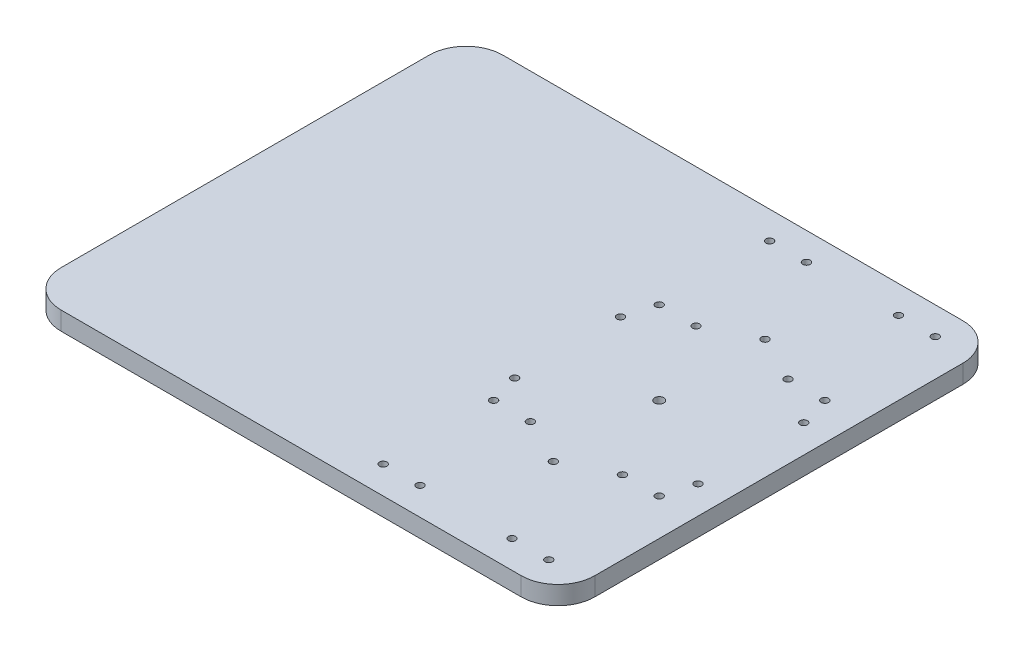
ISO-10303-21;
HEADER;
FILE_DESCRIPTION(('STEP AP214'),'2;1');
FILE_NAME('part.step','',(''),(''),'','','');
FILE_SCHEMA(('AUTOMOTIVE_DESIGN { 1 0 10303 214 1 1 1 1 }'));
ENDSEC;
DATA;
#1=APPLICATION_CONTEXT('core data for automotive mechanical design processes');
#2=APPLICATION_PROTOCOL_DEFINITION('international standard','automotive_design',2000,#1);
#3=PRODUCT_CONTEXT('',#1,'mechanical');
#4=PRODUCT('Part','Part','',(#3));
#5=PRODUCT_RELATED_PRODUCT_CATEGORY('part','',(#4));
#6=PRODUCT_DEFINITION_FORMATION('','',#4);
#7=PRODUCT_DEFINITION_CONTEXT('part definition',#1,'design');
#8=PRODUCT_DEFINITION('design','',#6,#7);
#9=PRODUCT_DEFINITION_SHAPE('','',#8);
#10=(LENGTH_UNIT() NAMED_UNIT(*) SI_UNIT(.MILLI.,.METRE.));
#11=(NAMED_UNIT(*) PLANE_ANGLE_UNIT() SI_UNIT($,.RADIAN.));
#12=(NAMED_UNIT(*) SI_UNIT($,.STERADIAN.) SOLID_ANGLE_UNIT());
#13=UNCERTAINTY_MEASURE_WITH_UNIT(LENGTH_MEASURE(1.E-05),#10,'distance_accuracy_value','');
#14=(GEOMETRIC_REPRESENTATION_CONTEXT(3) GLOBAL_UNCERTAINTY_ASSIGNED_CONTEXT((#13)) GLOBAL_UNIT_ASSIGNED_CONTEXT((#10,
#11,#12)) REPRESENTATION_CONTEXT('',''));
#15=CARTESIAN_POINT('',(0.,0.,0.));
#16=DIRECTION('',(0.,0.,1.));
#17=DIRECTION('',(1.,0.,0.));
#18=AXIS2_PLACEMENT_3D('',#15,#16,#17);
#19=CARTESIAN_POINT('',(-205.,10.,-100.));
#20=DIRECTION('',(0.,1.,0.));
#21=DIRECTION('',(0.,0.,1.));
#22=AXIS2_PLACEMENT_3D('',#19,#20,#21);
#23=PLANE('',#22);
#24=CARTESIAN_POINT('',(-25.,10.,105.));
#25=DIRECTION('',(0.,1.,0.));
#26=DIRECTION('',(0.,0.,-1.));
#27=AXIS2_PLACEMENT_3D('',#24,#25,#26);
#28=CIRCLE('',#27,2.00000000000001);
#29=CARTESIAN_POINT('',(-25.,10.,103.));
#30=VERTEX_POINT('',#29);
#31=EDGE_CURVE('E239',#30,#30,#28,.T.);
#32=ORIENTED_EDGE('',*,*,#31,.F.);
#33=EDGE_LOOP('',(#32));
#34=FACE_BOUND('',#33,.T.);
#35=CARTESIAN_POINT('',(45.,10.,105.));
#36=DIRECTION('',(0.,1.,0.));
#37=DIRECTION('',(0.,0.,-1.));
#38=AXIS2_PLACEMENT_3D('',#35,#36,#37);
#39=CIRCLE('',#38,2.);
#40=CARTESIAN_POINT('',(45.,10.,103.));
#41=VERTEX_POINT('',#40);
#42=EDGE_CURVE('E233',#41,#41,#39,.T.);
#43=ORIENTED_EDGE('',*,*,#42,.F.);
#44=EDGE_LOOP('',(#43));
#45=FACE_BOUND('',#44,.T.);
#46=CARTESIAN_POINT('',(25.,10.,45.));
#47=DIRECTION('',(0.,1.,0.));
#48=DIRECTION('',(0.,0.,-1.));
#49=AXIS2_PLACEMENT_3D('',#46,#47,#48);
#50=CIRCLE('',#49,2.00000000000001);
#51=CARTESIAN_POINT('',(25.,10.,43.));
#52=VERTEX_POINT('',#51);
#53=EDGE_CURVE('E227',#52,#52,#50,.T.);
#54=ORIENTED_EDGE('',*,*,#53,.F.);
#55=EDGE_LOOP('',(#54));
#56=FACE_BOUND('',#55,.T.);
#57=CARTESIAN_POINT('',(-45.,10.,45.));
#58=DIRECTION('',(0.,1.,0.));
#59=DIRECTION('',(0.,0.,-1.));
#60=AXIS2_PLACEMENT_3D('',#57,#58,#59);
#61=CIRCLE('',#60,2.);
#62=CARTESIAN_POINT('',(-45.,10.,43.));
#63=VERTEX_POINT('',#62);
#64=EDGE_CURVE('E221',#63,#63,#61,.T.);
#65=ORIENTED_EDGE('',*,*,#64,.F.);
#66=EDGE_LOOP('',(#65));
#67=FACE_BOUND('',#66,.T.);
#68=CARTESIAN_POINT('',(25.,10.,-45.));
#69=DIRECTION('',(0.,1.,0.));
#70=DIRECTION('',(0.,0.,1.));
#71=AXIS2_PLACEMENT_3D('',#68,#69,#70);
#72=CIRCLE('',#71,2.00000000000001);
#73=CARTESIAN_POINT('',(25.,10.,-43.));
#74=VERTEX_POINT('',#73);
#75=EDGE_CURVE('E215',#74,#74,#72,.T.);
#76=ORIENTED_EDGE('',*,*,#75,.F.);
#77=EDGE_LOOP('',(#76));
#78=FACE_BOUND('',#77,.T.);
#79=CARTESIAN_POINT('',(-45.,10.,-45.));
#80=DIRECTION('',(0.,1.,0.));
#81=DIRECTION('',(0.,0.,1.));
#82=AXIS2_PLACEMENT_3D('',#79,#80,#81);
#83=CIRCLE('',#82,2.);
#84=CARTESIAN_POINT('',(-45.,10.,-43.));
#85=VERTEX_POINT('',#84);
#86=EDGE_CURVE('E209',#85,#85,#83,.T.);
#87=ORIENTED_EDGE('',*,*,#86,.F.);
#88=EDGE_LOOP('',(#87));
#89=FACE_BOUND('',#88,.T.);
#90=CARTESIAN_POINT('',(25.,10.,-105.));
#91=DIRECTION('',(0.,1.,0.));
#92=DIRECTION('',(0.,0.,1.));
#93=AXIS2_PLACEMENT_3D('',#90,#91,#92);
#94=CIRCLE('',#93,2.00000000000001);
#95=CARTESIAN_POINT('',(25.,10.,-103.));
#96=VERTEX_POINT('',#95);
#97=EDGE_CURVE('E203',#96,#96,#94,.T.);
#98=ORIENTED_EDGE('',*,*,#97,.F.);
#99=EDGE_LOOP('',(#98));
#100=FACE_BOUND('',#99,.T.);
#101=CARTESIAN_POINT('',(-45.,10.,-105.));
#102=DIRECTION('',(0.,1.,0.));
#103=DIRECTION('',(0.,0.,1.));
#104=AXIS2_PLACEMENT_3D('',#101,#102,#103);
#105=CIRCLE('',#104,2.);
#106=CARTESIAN_POINT('',(-45.,10.,-103.));
#107=VERTEX_POINT('',#106);
#108=EDGE_CURVE('E197',#107,#107,#105,.T.);
#109=ORIENTED_EDGE('',*,*,#108,.F.);
#110=EDGE_LOOP('',(#109));
#111=FACE_BOUND('',#110,.T.);
#112=CARTESIAN_POINT('',(49.7964607176055,10.,-28.7499999999995));
#113=DIRECTION('',(0.,1.,0.));
#114=DIRECTION('',(0.,0.,1.));
#115=AXIS2_PLACEMENT_3D('',#112,#113,#114);
#116=CIRCLE('',#115,2.);
#117=CARTESIAN_POINT('',(49.7964607176055,10.,-26.7499999999995));
#118=VERTEX_POINT('',#117);
#119=EDGE_CURVE('E191',#118,#118,#116,.T.);
#120=ORIENTED_EDGE('',*,*,#119,.F.);
#121=EDGE_LOOP('',(#120));
#122=FACE_BOUND('',#121,.T.);
#123=CARTESIAN_POINT('',(-49.7964607176051,10.,-28.7500000000002));
#124=DIRECTION('',(0.,1.,0.));
#125=DIRECTION('',(0.,0.,1.));
#126=AXIS2_PLACEMENT_3D('',#123,#124,#125);
#127=CIRCLE('',#126,2.);
#128=CARTESIAN_POINT('',(-49.7964607176051,10.,-26.7500000000002));
#129=VERTEX_POINT('',#128);
#130=EDGE_CURVE('E185',#129,#129,#127,.T.);
#131=ORIENTED_EDGE('',*,*,#130,.F.);
#132=EDGE_LOOP('',(#131));
#133=FACE_BOUND('',#132,.T.);
#134=CARTESIAN_POINT('',(0.,10.,0.));
#135=DIRECTION('',(0.,1.,0.));
#136=DIRECTION('',(0.,0.,1.));
#137=AXIS2_PLACEMENT_3D('',#134,#135,#136);
#138=CIRCLE('',#137,2.5);
#139=CARTESIAN_POINT('',(0.,10.,2.5));
#140=VERTEX_POINT('',#139);
#141=EDGE_CURVE('E159',#140,#140,#138,.T.);
#142=ORIENTED_EDGE('',*,*,#141,.F.);
#143=EDGE_LOOP('',(#142));
#144=FACE_BOUND('',#143,.T.);
#145=CARTESIAN_POINT('',(-205.,10.,-100.));
#146=DIRECTION('',(0.,1.,0.));
#147=DIRECTION('',(0.,0.,1.));
#148=AXIS2_PLACEMENT_3D('',#145,#146,#147);
#149=CIRCLE('',#148,20.);
#150=CARTESIAN_POINT('',(-205.,10.,-120.));
#151=VERTEX_POINT('',#150);
#152=CARTESIAN_POINT('',(-225.,10.,-100.));
#153=VERTEX_POINT('',#152);
#154=EDGE_CURVE('E160',#151,#153,#149,.T.);
#155=ORIENTED_EDGE('',*,*,#154,.T.);
#156=DIRECTION('',(0.,0.,1.));
#157=VECTOR('',#156,1.);
#158=CARTESIAN_POINT('',(-225.,10.,100.));
#159=LINE('',#158,#157);
#160=CARTESIAN_POINT('',(-225.,10.,100.));
#161=VERTEX_POINT('',#160);
#162=EDGE_CURVE('E95',#153,#161,#159,.T.);
#163=ORIENTED_EDGE('',*,*,#162,.T.);
#164=CARTESIAN_POINT('',(-205.,10.,100.));
#165=DIRECTION('',(0.,1.,0.));
#166=DIRECTION('',(0.,0.,-1.));
#167=AXIS2_PLACEMENT_3D('',#164,#165,#166);
#168=CIRCLE('',#167,20.);
#169=CARTESIAN_POINT('',(-205.,10.,120.));
#170=VERTEX_POINT('',#169);
#171=EDGE_CURVE('E173',#161,#170,#168,.T.);
#172=ORIENTED_EDGE('',*,*,#171,.T.);
#173=DIRECTION('',(1.,0.,0.));
#174=VECTOR('',#173,1.);
#175=CARTESIAN_POINT('',(45.,10.,120.));
#176=LINE('',#175,#174);
#177=CARTESIAN_POINT('',(45.,10.,120.));
#178=VERTEX_POINT('',#177);
#179=EDGE_CURVE('E176',#170,#178,#176,.T.);
#180=ORIENTED_EDGE('',*,*,#179,.T.);
#181=CARTESIAN_POINT('',(45.,10.,100.));
#182=DIRECTION('',(0.,1.,0.));
#183=DIRECTION('',(0.,0.,-1.));
#184=AXIS2_PLACEMENT_3D('',#181,#182,#183);
#185=CIRCLE('',#184,20.);
#186=CARTESIAN_POINT('',(65.,10.,100.));
#187=VERTEX_POINT('',#186);
#188=EDGE_CURVE('E114',#178,#187,#185,.T.);
#189=ORIENTED_EDGE('',*,*,#188,.T.);
#190=DIRECTION('',(0.,0.,-1.));
#191=VECTOR('',#190,1.);
#192=CARTESIAN_POINT('',(65.,10.,-100.));
#193=LINE('',#192,#191);
#194=CARTESIAN_POINT('',(65.,10.,-100.));
#195=VERTEX_POINT('',#194);
#196=EDGE_CURVE('E108',#187,#195,#193,.T.);
#197=ORIENTED_EDGE('',*,*,#196,.T.);
#198=CARTESIAN_POINT('',(45.,10.,-100.));
#199=DIRECTION('',(0.,1.,0.));
#200=DIRECTION('',(0.,0.,1.));
#201=AXIS2_PLACEMENT_3D('',#198,#199,#200);
#202=CIRCLE('',#201,20.);
#203=CARTESIAN_POINT('',(45.,10.,-120.));
#204=VERTEX_POINT('',#203);
#205=EDGE_CURVE('E112',#195,#204,#202,.T.);
#206=ORIENTED_EDGE('',*,*,#205,.T.);
#207=DIRECTION('',(-1.,0.,0.));
#208=VECTOR('',#207,1.);
#209=CARTESIAN_POINT('',(-205.,10.,-120.));
#210=LINE('',#209,#208);
#211=EDGE_CURVE('E52',#204,#151,#210,.T.);
#212=ORIENTED_EDGE('',*,*,#211,.T.);
#213=EDGE_LOOP('',(#155,#163,#172,#180,#189,#197,#206,#212));
#214=FACE_BOUND('',#213,.T.);
#215=CARTESIAN_POINT('',(0.,10.,57.5));
#216=DIRECTION('',(0.,1.,0.));
#217=DIRECTION('',(0.,0.,1.));
#218=AXIS2_PLACEMENT_3D('',#215,#216,#217);
#219=CIRCLE('',#218,2.);
#220=CARTESIAN_POINT('',(0.,10.,59.5));
#221=VERTEX_POINT('',#220);
#222=EDGE_CURVE('E147',#221,#221,#219,.T.);
#223=ORIENTED_EDGE('',*,*,#222,.F.);
#224=EDGE_LOOP('',(#223));
#225=FACE_BOUND('',#224,.T.);
#226=CARTESIAN_POINT('',(-49.7964607176053,10.,28.7499999999999));
#227=DIRECTION('',(0.,1.,0.));
#228=DIRECTION('',(0.,0.,1.));
#229=AXIS2_PLACEMENT_3D('',#226,#227,#228);
#230=CIRCLE('',#229,2.);
#231=CARTESIAN_POINT('',(-49.7964607176053,10.,30.7499999999999));
#232=VERTEX_POINT('',#231);
#233=EDGE_CURVE('E565',#232,#232,#230,.T.);
#234=ORIENTED_EDGE('',*,*,#233,.F.);
#235=EDGE_LOOP('',(#234));
#236=FACE_BOUND('',#235,.T.);
#237=CARTESIAN_POINT('',(4.0152035396696E-13,10.,-57.5));
#238=DIRECTION('',(0.,1.,0.));
#239=DIRECTION('',(0.,0.,1.));
#240=AXIS2_PLACEMENT_3D('',#237,#238,#239);
#241=CIRCLE('',#240,2.);
#242=CARTESIAN_POINT('',(4.0152035396696E-13,10.,-55.5));
#243=VERTEX_POINT('',#242);
#244=EDGE_CURVE('E561',#243,#243,#241,.T.);
#245=ORIENTED_EDGE('',*,*,#244,.F.);
#246=EDGE_LOOP('',(#245));
#247=FACE_BOUND('',#246,.T.);
#248=CARTESIAN_POINT('',(49.7964607176049,10.,28.7500000000006));
#249=DIRECTION('',(0.,1.,0.));
#250=DIRECTION('',(0.,0.,1.));
#251=AXIS2_PLACEMENT_3D('',#248,#249,#250);
#252=CIRCLE('',#251,2.);
#253=CARTESIAN_POINT('',(49.7964607176049,10.,30.7500000000006));
#254=VERTEX_POINT('',#253);
#255=EDGE_CURVE('E557',#254,#254,#252,.T.);
#256=ORIENTED_EDGE('',*,*,#255,.F.);
#257=EDGE_LOOP('',(#256));
#258=FACE_BOUND('',#257,.T.);
#259=CARTESIAN_POINT('',(-25.,10.,-105.));
#260=DIRECTION('',(0.,1.,0.));
#261=DIRECTION('',(0.,0.,1.));
#262=AXIS2_PLACEMENT_3D('',#259,#260,#261);
#263=CIRCLE('',#262,2.00000000000001);
#264=CARTESIAN_POINT('',(-25.,10.,-103.));
#265=VERTEX_POINT('',#264);
#266=EDGE_CURVE('E553',#265,#265,#263,.T.);
#267=ORIENTED_EDGE('',*,*,#266,.F.);
#268=EDGE_LOOP('',(#267));
#269=FACE_BOUND('',#268,.T.);
#270=CARTESIAN_POINT('',(45.,10.,-105.));
#271=DIRECTION('',(0.,1.,0.));
#272=DIRECTION('',(0.,0.,1.));
#273=AXIS2_PLACEMENT_3D('',#270,#271,#272);
#274=CIRCLE('',#273,2.);
#275=CARTESIAN_POINT('',(45.,10.,-103.));
#276=VERTEX_POINT('',#275);
#277=EDGE_CURVE('E550',#276,#276,#274,.T.);
#278=ORIENTED_EDGE('',*,*,#277,.F.);
#279=EDGE_LOOP('',(#278));
#280=FACE_BOUND('',#279,.T.);
#281=CARTESIAN_POINT('',(-25.,10.,-45.));
#282=DIRECTION('',(0.,1.,0.));
#283=DIRECTION('',(0.,0.,1.));
#284=AXIS2_PLACEMENT_3D('',#281,#282,#283);
#285=CIRCLE('',#284,2.00000000000001);
#286=CARTESIAN_POINT('',(-25.,10.,-43.));
#287=VERTEX_POINT('',#286);
#288=EDGE_CURVE('E529',#287,#287,#285,.T.);
#289=ORIENTED_EDGE('',*,*,#288,.F.);
#290=EDGE_LOOP('',(#289));
#291=FACE_BOUND('',#290,.T.);
#292=CARTESIAN_POINT('',(45.,10.,-45.));
#293=DIRECTION('',(0.,1.,0.));
#294=DIRECTION('',(0.,0.,1.));
#295=AXIS2_PLACEMENT_3D('',#292,#293,#294);
#296=CIRCLE('',#295,2.);
#297=CARTESIAN_POINT('',(45.,10.,-43.));
#298=VERTEX_POINT('',#297);
#299=EDGE_CURVE('E528',#298,#298,#296,.T.);
#300=ORIENTED_EDGE('',*,*,#299,.F.);
#301=EDGE_LOOP('',(#300));
#302=FACE_BOUND('',#301,.T.);
#303=CARTESIAN_POINT('',(-25.,10.,45.));
#304=DIRECTION('',(0.,1.,0.));
#305=DIRECTION('',(0.,0.,-1.));
#306=AXIS2_PLACEMENT_3D('',#303,#304,#305);
#307=CIRCLE('',#306,2.00000000000001);
#308=CARTESIAN_POINT('',(-25.,10.,43.));
#309=VERTEX_POINT('',#308);
#310=EDGE_CURVE('E513',#309,#309,#307,.T.);
#311=ORIENTED_EDGE('',*,*,#310,.F.);
#312=EDGE_LOOP('',(#311));
#313=FACE_BOUND('',#312,.T.);
#314=CARTESIAN_POINT('',(45.,10.,45.));
#315=DIRECTION('',(0.,1.,0.));
#316=DIRECTION('',(0.,0.,-1.));
#317=AXIS2_PLACEMENT_3D('',#314,#315,#316);
#318=CIRCLE('',#317,2.);
#319=CARTESIAN_POINT('',(45.,10.,43.));
#320=VERTEX_POINT('',#319);
#321=EDGE_CURVE('E264',#320,#320,#318,.T.);
#322=ORIENTED_EDGE('',*,*,#321,.F.);
#323=EDGE_LOOP('',(#322));
#324=FACE_BOUND('',#323,.T.);
#325=CARTESIAN_POINT('',(25.,10.,105.));
#326=DIRECTION('',(0.,1.,0.));
#327=DIRECTION('',(0.,0.,-1.));
#328=AXIS2_PLACEMENT_3D('',#325,#326,#327);
#329=CIRCLE('',#328,2.00000000000001);
#330=CARTESIAN_POINT('',(25.,10.,103.));
#331=VERTEX_POINT('',#330);
#332=EDGE_CURVE('E247',#331,#331,#329,.T.);
#333=ORIENTED_EDGE('',*,*,#332,.F.);
#334=EDGE_LOOP('',(#333));
#335=FACE_BOUND('',#334,.T.);
#336=CARTESIAN_POINT('',(-45.,10.,105.));
#337=DIRECTION('',(0.,1.,0.));
#338=DIRECTION('',(0.,0.,-1.));
#339=AXIS2_PLACEMENT_3D('',#336,#337,#338);
#340=CIRCLE('',#339,2.);
#341=CARTESIAN_POINT('',(-45.,10.,103.));
#342=VERTEX_POINT('',#341);
#343=EDGE_CURVE('E250',#342,#342,#340,.T.);
#344=ORIENTED_EDGE('',*,*,#343,.F.);
#345=EDGE_LOOP('',(#344));
#346=FACE_BOUND('',#345,.T.);
#347=ADVANCED_FACE('F35',(#34,#45,#56,#67,#78,#89,#100,#111,#122,#133,#144,#214,#225,#236,#247,
#258,#269,#280,#291,#302,#313,#324,#335,#346),#23,.T.);
#348=CARTESIAN_POINT('',(-205.,0.,-100.));
#349=DIRECTION('',(0.,1.,0.));
#350=DIRECTION('',(0.,0.,1.));
#351=AXIS2_PLACEMENT_3D('',#348,#349,#350);
#352=PLANE('',#351);
#353=CARTESIAN_POINT('',(-205.,0.,-100.));
#354=DIRECTION('',(0.,1.,0.));
#355=DIRECTION('',(0.,0.,1.));
#356=AXIS2_PLACEMENT_3D('',#353,#354,#355);
#357=CIRCLE('',#356,20.);
#358=CARTESIAN_POINT('',(-205.,0.,-120.));
#359=VERTEX_POINT('',#358);
#360=CARTESIAN_POINT('',(-225.,0.,-100.));
#361=VERTEX_POINT('',#360);
#362=EDGE_CURVE('E153',#359,#361,#357,.T.);
#363=ORIENTED_EDGE('',*,*,#362,.F.);
#364=DIRECTION('',(-1.,0.,0.));
#365=VECTOR('',#364,1.);
#366=CARTESIAN_POINT('',(-205.,0.,-120.));
#367=LINE('',#366,#365);
#368=CARTESIAN_POINT('',(45.,0.,-120.));
#369=VERTEX_POINT('',#368);
#370=EDGE_CURVE('E87',#369,#359,#367,.T.);
#371=ORIENTED_EDGE('',*,*,#370,.F.);
#372=CARTESIAN_POINT('',(45.,0.,-100.));
#373=DIRECTION('',(0.,1.,0.));
#374=DIRECTION('',(0.,0.,1.));
#375=AXIS2_PLACEMENT_3D('',#372,#373,#374);
#376=CIRCLE('',#375,20.);
#377=CARTESIAN_POINT('',(65.,0.,-100.));
#378=VERTEX_POINT('',#377);
#379=EDGE_CURVE('E81',#378,#369,#376,.T.);
#380=ORIENTED_EDGE('',*,*,#379,.F.);
#381=DIRECTION('',(0.,0.,-1.));
#382=VECTOR('',#381,1.);
#383=CARTESIAN_POINT('',(65.,0.,-100.));
#384=LINE('',#383,#382);
#385=CARTESIAN_POINT('',(65.,0.,100.));
#386=VERTEX_POINT('',#385);
#387=EDGE_CURVE('E123',#386,#378,#384,.T.);
#388=ORIENTED_EDGE('',*,*,#387,.F.);
#389=CARTESIAN_POINT('',(45.,0.,100.));
#390=DIRECTION('',(0.,1.,0.));
#391=DIRECTION('',(0.,0.,-1.));
#392=AXIS2_PLACEMENT_3D('',#389,#390,#391);
#393=CIRCLE('',#392,20.);
#394=CARTESIAN_POINT('',(45.,0.,120.));
#395=VERTEX_POINT('',#394);
#396=EDGE_CURVE('E430',#395,#386,#393,.T.);
#397=ORIENTED_EDGE('',*,*,#396,.F.);
#398=DIRECTION('',(1.,0.,0.));
#399=VECTOR('',#398,1.);
#400=CARTESIAN_POINT('',(45.,0.,120.));
#401=LINE('',#400,#399);
#402=CARTESIAN_POINT('',(-205.,0.,120.));
#403=VERTEX_POINT('',#402);
#404=EDGE_CURVE('E428',#403,#395,#401,.T.);
#405=ORIENTED_EDGE('',*,*,#404,.F.);
#406=CARTESIAN_POINT('',(-205.,0.,100.));
#407=DIRECTION('',(0.,1.,0.));
#408=DIRECTION('',(0.,0.,-1.));
#409=AXIS2_PLACEMENT_3D('',#406,#407,#408);
#410=CIRCLE('',#409,20.);
#411=CARTESIAN_POINT('',(-225.,0.,100.));
#412=VERTEX_POINT('',#411);
#413=EDGE_CURVE('E420',#412,#403,#410,.T.);
#414=ORIENTED_EDGE('',*,*,#413,.F.);
#415=DIRECTION('',(0.,0.,1.));
#416=VECTOR('',#415,1.);
#417=CARTESIAN_POINT('',(-225.,0.,100.));
#418=LINE('',#417,#416);
#419=EDGE_CURVE('E413',#361,#412,#418,.T.);
#420=ORIENTED_EDGE('',*,*,#419,.F.);
#421=EDGE_LOOP('',(#363,#371,#380,#388,#397,#405,#414,#420));
#422=FACE_BOUND('',#421,.T.);
#423=CARTESIAN_POINT('',(0.,0.,57.5));
#424=DIRECTION('',(0.,1.,0.));
#425=DIRECTION('',(0.,0.,1.));
#426=AXIS2_PLACEMENT_3D('',#423,#424,#425);
#427=CIRCLE('',#426,2.);
#428=CARTESIAN_POINT('',(0.,0.,59.5));
#429=VERTEX_POINT('',#428);
#430=EDGE_CURVE('E154',#429,#429,#427,.T.);
#431=ORIENTED_EDGE('',*,*,#430,.T.);
#432=EDGE_LOOP('',(#431));
#433=FACE_BOUND('',#432,.T.);
#434=CARTESIAN_POINT('',(0.,0.,0.));
#435=DIRECTION('',(0.,1.,0.));
#436=DIRECTION('',(0.,0.,1.));
#437=AXIS2_PLACEMENT_3D('',#434,#435,#436);
#438=CIRCLE('',#437,2.5);
#439=CARTESIAN_POINT('',(0.,0.,2.5));
#440=VERTEX_POINT('',#439);
#441=EDGE_CURVE('E155',#440,#440,#438,.T.);
#442=ORIENTED_EDGE('',*,*,#441,.T.);
#443=EDGE_LOOP('',(#442));
#444=FACE_BOUND('',#443,.T.);
#445=CARTESIAN_POINT('',(-49.7964607176053,0.,28.7499999999999));
#446=DIRECTION('',(0.,1.,0.));
#447=DIRECTION('',(0.,0.,1.));
#448=AXIS2_PLACEMENT_3D('',#445,#446,#447);
#449=CIRCLE('',#448,2.);
#450=CARTESIAN_POINT('',(-49.7964607176053,0.,30.7499999999999));
#451=VERTEX_POINT('',#450);
#452=EDGE_CURVE('E188',#451,#451,#449,.T.);
#453=ORIENTED_EDGE('',*,*,#452,.T.);
#454=EDGE_LOOP('',(#453));
#455=FACE_BOUND('',#454,.T.);
#456=CARTESIAN_POINT('',(-49.7964607176051,0.,-28.7500000000002));
#457=DIRECTION('',(0.,1.,0.));
#458=DIRECTION('',(0.,0.,1.));
#459=AXIS2_PLACEMENT_3D('',#456,#457,#458);
#460=CIRCLE('',#459,2.);
#461=CARTESIAN_POINT('',(-49.7964607176051,0.,-26.7500000000002));
#462=VERTEX_POINT('',#461);
#463=EDGE_CURVE('E189',#462,#462,#460,.T.);
#464=ORIENTED_EDGE('',*,*,#463,.T.);
#465=EDGE_LOOP('',(#464));
#466=FACE_BOUND('',#465,.T.);
#467=CARTESIAN_POINT('',(4.0152035396696E-13,0.,-57.5));
#468=DIRECTION('',(0.,1.,0.));
#469=DIRECTION('',(0.,0.,1.));
#470=AXIS2_PLACEMENT_3D('',#467,#468,#469);
#471=CIRCLE('',#470,2.);
#472=CARTESIAN_POINT('',(4.0152035396696E-13,0.,-55.5));
#473=VERTEX_POINT('',#472);
#474=EDGE_CURVE('E194',#473,#473,#471,.T.);
#475=ORIENTED_EDGE('',*,*,#474,.T.);
#476=EDGE_LOOP('',(#475));
#477=FACE_BOUND('',#476,.T.);
#478=CARTESIAN_POINT('',(49.7964607176055,0.,-28.7499999999995));
#479=DIRECTION('',(0.,1.,0.));
#480=DIRECTION('',(0.,0.,1.));
#481=AXIS2_PLACEMENT_3D('',#478,#479,#480);
#482=CIRCLE('',#481,2.);
#483=CARTESIAN_POINT('',(49.7964607176055,0.,-26.7499999999995));
#484=VERTEX_POINT('',#483);
#485=EDGE_CURVE('E195',#484,#484,#482,.T.);
#486=ORIENTED_EDGE('',*,*,#485,.T.);
#487=EDGE_LOOP('',(#486));
#488=FACE_BOUND('',#487,.T.);
#489=CARTESIAN_POINT('',(49.7964607176049,0.,28.7500000000006));
#490=DIRECTION('',(0.,1.,0.));
#491=DIRECTION('',(0.,0.,1.));
#492=AXIS2_PLACEMENT_3D('',#489,#490,#491);
#493=CIRCLE('',#492,2.);
#494=CARTESIAN_POINT('',(49.7964607176049,0.,30.7500000000006));
#495=VERTEX_POINT('',#494);
#496=EDGE_CURVE('E200',#495,#495,#493,.T.);
#497=ORIENTED_EDGE('',*,*,#496,.T.);
#498=EDGE_LOOP('',(#497));
#499=FACE_BOUND('',#498,.T.);
#500=CARTESIAN_POINT('',(-45.,0.,-105.));
#501=DIRECTION('',(0.,1.,0.));
#502=DIRECTION('',(0.,0.,1.));
#503=AXIS2_PLACEMENT_3D('',#500,#501,#502);
#504=CIRCLE('',#503,2.);
#505=CARTESIAN_POINT('',(-45.,0.,-103.));
#506=VERTEX_POINT('',#505);
#507=EDGE_CURVE('E201',#506,#506,#504,.T.);
#508=ORIENTED_EDGE('',*,*,#507,.T.);
#509=EDGE_LOOP('',(#508));
#510=FACE_BOUND('',#509,.T.);
#511=CARTESIAN_POINT('',(-25.,0.,-105.));
#512=DIRECTION('',(0.,1.,0.));
#513=DIRECTION('',(0.,0.,1.));
#514=AXIS2_PLACEMENT_3D('',#511,#512,#513);
#515=CIRCLE('',#514,2.00000000000001);
#516=CARTESIAN_POINT('',(-25.,0.,-103.));
#517=VERTEX_POINT('',#516);
#518=EDGE_CURVE('E206',#517,#517,#515,.T.);
#519=ORIENTED_EDGE('',*,*,#518,.T.);
#520=EDGE_LOOP('',(#519));
#521=FACE_BOUND('',#520,.T.);
#522=CARTESIAN_POINT('',(25.,0.,-105.));
#523=DIRECTION('',(0.,1.,0.));
#524=DIRECTION('',(0.,0.,1.));
#525=AXIS2_PLACEMENT_3D('',#522,#523,#524);
#526=CIRCLE('',#525,2.00000000000001);
#527=CARTESIAN_POINT('',(25.,0.,-103.));
#528=VERTEX_POINT('',#527);
#529=EDGE_CURVE('E207',#528,#528,#526,.T.);
#530=ORIENTED_EDGE('',*,*,#529,.T.);
#531=EDGE_LOOP('',(#530));
#532=FACE_BOUND('',#531,.T.);
#533=CARTESIAN_POINT('',(45.,0.,-105.));
#534=DIRECTION('',(0.,1.,0.));
#535=DIRECTION('',(0.,0.,1.));
#536=AXIS2_PLACEMENT_3D('',#533,#534,#535);
#537=CIRCLE('',#536,2.);
#538=CARTESIAN_POINT('',(45.,0.,-103.));
#539=VERTEX_POINT('',#538);
#540=EDGE_CURVE('E212',#539,#539,#537,.T.);
#541=ORIENTED_EDGE('',*,*,#540,.T.);
#542=EDGE_LOOP('',(#541));
#543=FACE_BOUND('',#542,.T.);
#544=CARTESIAN_POINT('',(-45.,0.,-45.));
#545=DIRECTION('',(0.,1.,0.));
#546=DIRECTION('',(0.,0.,1.));
#547=AXIS2_PLACEMENT_3D('',#544,#545,#546);
#548=CIRCLE('',#547,2.);
#549=CARTESIAN_POINT('',(-45.,0.,-43.));
#550=VERTEX_POINT('',#549);
#551=EDGE_CURVE('E213',#550,#550,#548,.T.);
#552=ORIENTED_EDGE('',*,*,#551,.T.);
#553=EDGE_LOOP('',(#552));
#554=FACE_BOUND('',#553,.T.);
#555=CARTESIAN_POINT('',(-25.,0.,-45.));
#556=DIRECTION('',(0.,1.,0.));
#557=DIRECTION('',(0.,0.,1.));
#558=AXIS2_PLACEMENT_3D('',#555,#556,#557);
#559=CIRCLE('',#558,2.00000000000001);
#560=CARTESIAN_POINT('',(-25.,0.,-43.));
#561=VERTEX_POINT('',#560);
#562=EDGE_CURVE('E218',#561,#561,#559,.T.);
#563=ORIENTED_EDGE('',*,*,#562,.T.);
#564=EDGE_LOOP('',(#563));
#565=FACE_BOUND('',#564,.T.);
#566=CARTESIAN_POINT('',(25.,0.,-45.));
#567=DIRECTION('',(0.,1.,0.));
#568=DIRECTION('',(0.,0.,1.));
#569=AXIS2_PLACEMENT_3D('',#566,#567,#568);
#570=CIRCLE('',#569,2.00000000000001);
#571=CARTESIAN_POINT('',(25.,0.,-43.));
#572=VERTEX_POINT('',#571);
#573=EDGE_CURVE('E219',#572,#572,#570,.T.);
#574=ORIENTED_EDGE('',*,*,#573,.T.);
#575=EDGE_LOOP('',(#574));
#576=FACE_BOUND('',#575,.T.);
#577=CARTESIAN_POINT('',(45.,0.,-45.));
#578=DIRECTION('',(0.,1.,0.));
#579=DIRECTION('',(0.,0.,1.));
#580=AXIS2_PLACEMENT_3D('',#577,#578,#579);
#581=CIRCLE('',#580,2.);
#582=CARTESIAN_POINT('',(45.,0.,-43.));
#583=VERTEX_POINT('',#582);
#584=EDGE_CURVE('E224',#583,#583,#581,.T.);
#585=ORIENTED_EDGE('',*,*,#584,.T.);
#586=EDGE_LOOP('',(#585));
#587=FACE_BOUND('',#586,.T.);
#588=CARTESIAN_POINT('',(-45.,0.,45.));
#589=DIRECTION('',(0.,1.,0.));
#590=DIRECTION('',(0.,0.,-1.));
#591=AXIS2_PLACEMENT_3D('',#588,#589,#590);
#592=CIRCLE('',#591,2.);
#593=CARTESIAN_POINT('',(-45.,0.,43.));
#594=VERTEX_POINT('',#593);
#595=EDGE_CURVE('E225',#594,#594,#592,.T.);
#596=ORIENTED_EDGE('',*,*,#595,.T.);
#597=EDGE_LOOP('',(#596));
#598=FACE_BOUND('',#597,.T.);
#599=CARTESIAN_POINT('',(-25.,0.,45.));
#600=DIRECTION('',(0.,1.,0.));
#601=DIRECTION('',(0.,0.,-1.));
#602=AXIS2_PLACEMENT_3D('',#599,#600,#601);
#603=CIRCLE('',#602,2.00000000000001);
#604=CARTESIAN_POINT('',(-25.,0.,43.));
#605=VERTEX_POINT('',#604);
#606=EDGE_CURVE('E230',#605,#605,#603,.T.);
#607=ORIENTED_EDGE('',*,*,#606,.T.);
#608=EDGE_LOOP('',(#607));
#609=FACE_BOUND('',#608,.T.);
#610=CARTESIAN_POINT('',(25.,0.,45.));
#611=DIRECTION('',(0.,1.,0.));
#612=DIRECTION('',(0.,0.,-1.));
#613=AXIS2_PLACEMENT_3D('',#610,#611,#612);
#614=CIRCLE('',#613,2.00000000000001);
#615=CARTESIAN_POINT('',(25.,0.,43.));
#616=VERTEX_POINT('',#615);
#617=EDGE_CURVE('E231',#616,#616,#614,.T.);
#618=ORIENTED_EDGE('',*,*,#617,.T.);
#619=EDGE_LOOP('',(#618));
#620=FACE_BOUND('',#619,.T.);
#621=CARTESIAN_POINT('',(45.,0.,45.));
#622=DIRECTION('',(0.,1.,0.));
#623=DIRECTION('',(0.,0.,-1.));
#624=AXIS2_PLACEMENT_3D('',#621,#622,#623);
#625=CIRCLE('',#624,2.);
#626=CARTESIAN_POINT('',(45.,0.,43.));
#627=VERTEX_POINT('',#626);
#628=EDGE_CURVE('E236',#627,#627,#625,.T.);
#629=ORIENTED_EDGE('',*,*,#628,.T.);
#630=EDGE_LOOP('',(#629));
#631=FACE_BOUND('',#630,.T.);
#632=CARTESIAN_POINT('',(45.,0.,105.));
#633=DIRECTION('',(0.,1.,0.));
#634=DIRECTION('',(0.,0.,-1.));
#635=AXIS2_PLACEMENT_3D('',#632,#633,#634);
#636=CIRCLE('',#635,2.);
#637=CARTESIAN_POINT('',(45.,0.,103.));
#638=VERTEX_POINT('',#637);
#639=EDGE_CURVE('E237',#638,#638,#636,.T.);
#640=ORIENTED_EDGE('',*,*,#639,.T.);
#641=EDGE_LOOP('',(#640));
#642=FACE_BOUND('',#641,.T.);
#643=CARTESIAN_POINT('',(25.,0.,105.));
#644=DIRECTION('',(0.,1.,0.));
#645=DIRECTION('',(0.,0.,-1.));
#646=AXIS2_PLACEMENT_3D('',#643,#644,#645);
#647=CIRCLE('',#646,2.00000000000001);
#648=CARTESIAN_POINT('',(25.,0.,103.));
#649=VERTEX_POINT('',#648);
#650=EDGE_CURVE('E241',#649,#649,#647,.T.);
#651=ORIENTED_EDGE('',*,*,#650,.T.);
#652=EDGE_LOOP('',(#651));
#653=FACE_BOUND('',#652,.T.);
#654=CARTESIAN_POINT('',(-25.,0.,105.));
#655=DIRECTION('',(0.,1.,0.));
#656=DIRECTION('',(0.,0.,-1.));
#657=AXIS2_PLACEMENT_3D('',#654,#655,#656);
#658=CIRCLE('',#657,2.00000000000001);
#659=CARTESIAN_POINT('',(-25.,0.,103.));
#660=VERTEX_POINT('',#659);
#661=EDGE_CURVE('E242',#660,#660,#658,.T.);
#662=ORIENTED_EDGE('',*,*,#661,.T.);
#663=EDGE_LOOP('',(#662));
#664=FACE_BOUND('',#663,.T.);
#665=CARTESIAN_POINT('',(-45.,0.,105.));
#666=DIRECTION('',(0.,1.,0.));
#667=DIRECTION('',(0.,0.,-1.));
#668=AXIS2_PLACEMENT_3D('',#665,#666,#667);
#669=CIRCLE('',#668,2.);
#670=CARTESIAN_POINT('',(-45.,0.,103.));
#671=VERTEX_POINT('',#670);
#672=EDGE_CURVE('E254',#671,#671,#669,.T.);
#673=ORIENTED_EDGE('',*,*,#672,.T.);
#674=EDGE_LOOP('',(#673));
#675=FACE_BOUND('',#674,.T.);
#676=ADVANCED_FACE('F284',(#422,#433,#444,#455,#466,#477,#488,#499,#510,#521,#532,#543,#554,
#565,#576,#587,#598,#609,#620,#631,#642,#653,#664,#675),#352,.F.);
#677=CARTESIAN_POINT('',(-205.,10.,-100.));
#678=DIRECTION('',(0.,-1.,0.));
#679=DIRECTION('',(0.,0.,-1.));
#680=AXIS2_PLACEMENT_3D('',#677,#678,#679);
#681=CYLINDRICAL_SURFACE('',#680,20.);
#682=ORIENTED_EDGE('',*,*,#362,.T.);
#683=DIRECTION('',(0.,-1.,0.));
#684=VECTOR('',#683,1.);
#685=CARTESIAN_POINT('',(-225.,10.,-100.));
#686=LINE('',#685,#684);
#687=EDGE_CURVE('E12',#153,#361,#686,.T.);
#688=ORIENTED_EDGE('',*,*,#687,.F.);
#689=ORIENTED_EDGE('',*,*,#154,.F.);
#690=DIRECTION('',(0.,-1.,0.));
#691=VECTOR('',#690,1.);
#692=CARTESIAN_POINT('',(-205.,10.,-120.));
#693=LINE('',#692,#691);
#694=EDGE_CURVE('E131',#151,#359,#693,.T.);
#695=ORIENTED_EDGE('',*,*,#694,.T.);
#696=EDGE_LOOP('',(#682,#688,#689,#695));
#697=FACE_BOUND('',#696,.T.);
#698=ADVANCED_FACE('F37',(#697),#681,.T.);
#699=CARTESIAN_POINT('',(-225.,10.,100.));
#700=DIRECTION('',(1.,0.,0.));
#701=DIRECTION('',(0.,0.,-1.));
#702=AXIS2_PLACEMENT_3D('',#699,#700,#701);
#703=PLANE('',#702);
#704=ORIENTED_EDGE('',*,*,#419,.T.);
#705=DIRECTION('',(0.,-1.,0.));
#706=VECTOR('',#705,1.);
#707=CARTESIAN_POINT('',(-225.,10.,100.));
#708=LINE('',#707,#706);
#709=EDGE_CURVE('E44',#161,#412,#708,.T.);
#710=ORIENTED_EDGE('',*,*,#709,.F.);
#711=ORIENTED_EDGE('',*,*,#162,.F.);
#712=ORIENTED_EDGE('',*,*,#687,.T.);
#713=EDGE_LOOP('',(#704,#710,#711,#712));
#714=FACE_BOUND('',#713,.T.);
#715=ADVANCED_FACE('F406',(#714),#703,.F.);
#716=CARTESIAN_POINT('',(-205.,10.,100.));
#717=DIRECTION('',(0.,-1.,0.));
#718=DIRECTION('',(0.,0.,-1.));
#719=AXIS2_PLACEMENT_3D('',#716,#717,#718);
#720=CYLINDRICAL_SURFACE('',#719,20.);
#721=ORIENTED_EDGE('',*,*,#413,.T.);
#722=DIRECTION('',(0.,-1.,0.));
#723=VECTOR('',#722,1.);
#724=CARTESIAN_POINT('',(-205.,10.,120.));
#725=LINE('',#724,#723);
#726=EDGE_CURVE('E424',#170,#403,#725,.T.);
#727=ORIENTED_EDGE('',*,*,#726,.F.);
#728=ORIENTED_EDGE('',*,*,#171,.F.);
#729=ORIENTED_EDGE('',*,*,#709,.T.);
#730=EDGE_LOOP('',(#721,#727,#728,#729));
#731=FACE_BOUND('',#730,.T.);
#732=ADVANCED_FACE('F403',(#731),#720,.T.);
#733=CARTESIAN_POINT('',(45.,10.,120.));
#734=DIRECTION('',(0.,0.,-1.));
#735=DIRECTION('',(-1.,0.,0.));
#736=AXIS2_PLACEMENT_3D('',#733,#734,#735);
#737=PLANE('',#736);
#738=ORIENTED_EDGE('',*,*,#404,.T.);
#739=DIRECTION('',(0.,-1.,0.));
#740=VECTOR('',#739,1.);
#741=CARTESIAN_POINT('',(45.,10.,120.));
#742=LINE('',#741,#740);
#743=EDGE_CURVE('E440',#178,#395,#742,.T.);
#744=ORIENTED_EDGE('',*,*,#743,.F.);
#745=ORIENTED_EDGE('',*,*,#179,.F.);
#746=ORIENTED_EDGE('',*,*,#726,.T.);
#747=EDGE_LOOP('',(#738,#744,#745,#746));
#748=FACE_BOUND('',#747,.T.);
#749=ADVANCED_FACE('F399',(#748),#737,.F.);
#750=CARTESIAN_POINT('',(45.,10.,100.));
#751=DIRECTION('',(0.,-1.,0.));
#752=DIRECTION('',(0.,0.,-1.));
#753=AXIS2_PLACEMENT_3D('',#750,#751,#752);
#754=CYLINDRICAL_SURFACE('',#753,20.);
#755=ORIENTED_EDGE('',*,*,#396,.T.);
#756=DIRECTION('',(0.,-1.,0.));
#757=VECTOR('',#756,1.);
#758=CARTESIAN_POINT('',(65.,10.,100.));
#759=LINE('',#758,#757);
#760=EDGE_CURVE('E124',#187,#386,#759,.T.);
#761=ORIENTED_EDGE('',*,*,#760,.F.);
#762=ORIENTED_EDGE('',*,*,#188,.F.);
#763=ORIENTED_EDGE('',*,*,#743,.T.);
#764=EDGE_LOOP('',(#755,#761,#762,#763));
#765=FACE_BOUND('',#764,.T.);
#766=ADVANCED_FACE('F396',(#765),#754,.T.);
#767=CARTESIAN_POINT('',(65.,10.,-100.));
#768=DIRECTION('',(-1.,0.,0.));
#769=DIRECTION('',(0.,0.,1.));
#770=AXIS2_PLACEMENT_3D('',#767,#768,#769);
#771=PLANE('',#770);
#772=ORIENTED_EDGE('',*,*,#387,.T.);
#773=DIRECTION('',(0.,-1.,0.));
#774=VECTOR('',#773,1.);
#775=CARTESIAN_POINT('',(65.,10.,-100.));
#776=LINE('',#775,#774);
#777=EDGE_CURVE('E120',#195,#378,#776,.T.);
#778=ORIENTED_EDGE('',*,*,#777,.F.);
#779=ORIENTED_EDGE('',*,*,#196,.F.);
#780=ORIENTED_EDGE('',*,*,#760,.T.);
#781=EDGE_LOOP('',(#772,#778,#779,#780));
#782=FACE_BOUND('',#781,.T.);
#783=ADVANCED_FACE('F121',(#782),#771,.F.);
#784=CARTESIAN_POINT('',(45.,10.,-100.));
#785=DIRECTION('',(0.,-1.,0.));
#786=DIRECTION('',(0.,0.,-1.));
#787=AXIS2_PLACEMENT_3D('',#784,#785,#786);
#788=CYLINDRICAL_SURFACE('',#787,20.);
#789=ORIENTED_EDGE('',*,*,#379,.T.);
#790=DIRECTION('',(0.,-1.,0.));
#791=VECTOR('',#790,1.);
#792=CARTESIAN_POINT('',(45.,10.,-120.));
#793=LINE('',#792,#791);
#794=EDGE_CURVE('E125',#204,#369,#793,.T.);
#795=ORIENTED_EDGE('',*,*,#794,.F.);
#796=ORIENTED_EDGE('',*,*,#205,.F.);
#797=ORIENTED_EDGE('',*,*,#777,.T.);
#798=EDGE_LOOP('',(#789,#795,#796,#797));
#799=FACE_BOUND('',#798,.T.);
#800=ADVANCED_FACE('F127',(#799),#788,.T.);
#801=CARTESIAN_POINT('',(-205.,10.,-120.));
#802=DIRECTION('',(0.,0.,1.));
#803=DIRECTION('',(1.,0.,0.));
#804=AXIS2_PLACEMENT_3D('',#801,#802,#803);
#805=PLANE('',#804);
#806=ORIENTED_EDGE('',*,*,#370,.T.);
#807=ORIENTED_EDGE('',*,*,#694,.F.);
#808=ORIENTED_EDGE('',*,*,#211,.F.);
#809=ORIENTED_EDGE('',*,*,#794,.T.);
#810=EDGE_LOOP('',(#806,#807,#808,#809));
#811=FACE_BOUND('',#810,.T.);
#812=ADVANCED_FACE('F384',(#811),#805,.F.);
#813=CARTESIAN_POINT('',(0.,10.,57.5));
#814=DIRECTION('',(0.,-1.,0.));
#815=DIRECTION('',(0.,0.,-1.));
#816=AXIS2_PLACEMENT_3D('',#813,#814,#815);
#817=CYLINDRICAL_SURFACE('',#816,2.);
#818=ORIENTED_EDGE('',*,*,#222,.T.);
#819=EDGE_LOOP('',(#818));
#820=FACE_BOUND('',#819,.T.);
#821=ORIENTED_EDGE('',*,*,#430,.F.);
#822=EDGE_LOOP('',(#821));
#823=FACE_BOUND('',#822,.T.);
#824=ADVANCED_FACE('F381',(#820,#823),#817,.F.);
#825=CARTESIAN_POINT('',(0.,10.,0.));
#826=DIRECTION('',(0.,-1.,0.));
#827=DIRECTION('',(0.,0.,-1.));
#828=AXIS2_PLACEMENT_3D('',#825,#826,#827);
#829=CYLINDRICAL_SURFACE('',#828,2.5);
#830=ORIENTED_EDGE('',*,*,#141,.T.);
#831=EDGE_LOOP('',(#830));
#832=FACE_BOUND('',#831,.T.);
#833=ORIENTED_EDGE('',*,*,#441,.F.);
#834=EDGE_LOOP('',(#833));
#835=FACE_BOUND('',#834,.T.);
#836=ADVANCED_FACE('F377',(#832,#835),#829,.F.);
#837=CARTESIAN_POINT('',(-49.7964607176053,10.,28.7499999999999));
#838=DIRECTION('',(0.,-1.,0.));
#839=DIRECTION('',(0.,0.,-1.));
#840=AXIS2_PLACEMENT_3D('',#837,#838,#839);
#841=CYLINDRICAL_SURFACE('',#840,2.);
#842=ORIENTED_EDGE('',*,*,#233,.T.);
#843=EDGE_LOOP('',(#842));
#844=FACE_BOUND('',#843,.T.);
#845=ORIENTED_EDGE('',*,*,#452,.F.);
#846=EDGE_LOOP('',(#845));
#847=FACE_BOUND('',#846,.T.);
#848=ADVANCED_FACE('F373',(#844,#847),#841,.F.);
#849=CARTESIAN_POINT('',(-49.7964607176051,10.,-28.7500000000002));
#850=DIRECTION('',(0.,-1.,0.));
#851=DIRECTION('',(0.,0.,-1.));
#852=AXIS2_PLACEMENT_3D('',#849,#850,#851);
#853=CYLINDRICAL_SURFACE('',#852,2.);
#854=ORIENTED_EDGE('',*,*,#130,.T.);
#855=EDGE_LOOP('',(#854));
#856=FACE_BOUND('',#855,.T.);
#857=ORIENTED_EDGE('',*,*,#463,.F.);
#858=EDGE_LOOP('',(#857));
#859=FACE_BOUND('',#858,.T.);
#860=ADVANCED_FACE('F369',(#856,#859),#853,.F.);
#861=CARTESIAN_POINT('',(4.0152035396696E-13,10.,-57.5));
#862=DIRECTION('',(0.,-1.,0.));
#863=DIRECTION('',(0.,0.,-1.));
#864=AXIS2_PLACEMENT_3D('',#861,#862,#863);
#865=CYLINDRICAL_SURFACE('',#864,2.);
#866=ORIENTED_EDGE('',*,*,#244,.T.);
#867=EDGE_LOOP('',(#866));
#868=FACE_BOUND('',#867,.T.);
#869=ORIENTED_EDGE('',*,*,#474,.F.);
#870=EDGE_LOOP('',(#869));
#871=FACE_BOUND('',#870,.T.);
#872=ADVANCED_FACE('F365',(#868,#871),#865,.F.);
#873=CARTESIAN_POINT('',(49.7964607176055,10.,-28.7499999999995));
#874=DIRECTION('',(0.,-1.,0.));
#875=DIRECTION('',(0.,0.,-1.));
#876=AXIS2_PLACEMENT_3D('',#873,#874,#875);
#877=CYLINDRICAL_SURFACE('',#876,2.);
#878=ORIENTED_EDGE('',*,*,#119,.T.);
#879=EDGE_LOOP('',(#878));
#880=FACE_BOUND('',#879,.T.);
#881=ORIENTED_EDGE('',*,*,#485,.F.);
#882=EDGE_LOOP('',(#881));
#883=FACE_BOUND('',#882,.T.);
#884=ADVANCED_FACE('F361',(#880,#883),#877,.F.);
#885=CARTESIAN_POINT('',(49.7964607176049,10.,28.7500000000006));
#886=DIRECTION('',(0.,-1.,0.));
#887=DIRECTION('',(0.,0.,-1.));
#888=AXIS2_PLACEMENT_3D('',#885,#886,#887);
#889=CYLINDRICAL_SURFACE('',#888,2.);
#890=ORIENTED_EDGE('',*,*,#255,.T.);
#891=EDGE_LOOP('',(#890));
#892=FACE_BOUND('',#891,.T.);
#893=ORIENTED_EDGE('',*,*,#496,.F.);
#894=EDGE_LOOP('',(#893));
#895=FACE_BOUND('',#894,.T.);
#896=ADVANCED_FACE('F357',(#892,#895),#889,.F.);
#897=CARTESIAN_POINT('',(-45.,10.,-105.));
#898=DIRECTION('',(0.,-1.,0.));
#899=DIRECTION('',(0.,0.,-1.));
#900=AXIS2_PLACEMENT_3D('',#897,#898,#899);
#901=CYLINDRICAL_SURFACE('',#900,2.);
#902=ORIENTED_EDGE('',*,*,#108,.T.);
#903=EDGE_LOOP('',(#902));
#904=FACE_BOUND('',#903,.T.);
#905=ORIENTED_EDGE('',*,*,#507,.F.);
#906=EDGE_LOOP('',(#905));
#907=FACE_BOUND('',#906,.T.);
#908=ADVANCED_FACE('F353',(#904,#907),#901,.F.);
#909=CARTESIAN_POINT('',(-25.,10.,-105.));
#910=DIRECTION('',(0.,-1.,0.));
#911=DIRECTION('',(0.,0.,-1.));
#912=AXIS2_PLACEMENT_3D('',#909,#910,#911);
#913=CYLINDRICAL_SURFACE('',#912,2.00000000000001);
#914=ORIENTED_EDGE('',*,*,#266,.T.);
#915=EDGE_LOOP('',(#914));
#916=FACE_BOUND('',#915,.T.);
#917=ORIENTED_EDGE('',*,*,#518,.F.);
#918=EDGE_LOOP('',(#917));
#919=FACE_BOUND('',#918,.T.);
#920=ADVANCED_FACE('F349',(#916,#919),#913,.F.);
#921=CARTESIAN_POINT('',(25.,10.,-105.));
#922=DIRECTION('',(0.,-1.,0.));
#923=DIRECTION('',(0.,0.,-1.));
#924=AXIS2_PLACEMENT_3D('',#921,#922,#923);
#925=CYLINDRICAL_SURFACE('',#924,2.00000000000001);
#926=ORIENTED_EDGE('',*,*,#97,.T.);
#927=EDGE_LOOP('',(#926));
#928=FACE_BOUND('',#927,.T.);
#929=ORIENTED_EDGE('',*,*,#529,.F.);
#930=EDGE_LOOP('',(#929));
#931=FACE_BOUND('',#930,.T.);
#932=ADVANCED_FACE('F345',(#928,#931),#925,.F.);
#933=CARTESIAN_POINT('',(45.,10.,-105.));
#934=DIRECTION('',(0.,-1.,0.));
#935=DIRECTION('',(0.,0.,-1.));
#936=AXIS2_PLACEMENT_3D('',#933,#934,#935);
#937=CYLINDRICAL_SURFACE('',#936,2.);
#938=ORIENTED_EDGE('',*,*,#277,.T.);
#939=EDGE_LOOP('',(#938));
#940=FACE_BOUND('',#939,.T.);
#941=ORIENTED_EDGE('',*,*,#540,.F.);
#942=EDGE_LOOP('',(#941));
#943=FACE_BOUND('',#942,.T.);
#944=ADVANCED_FACE('F341',(#940,#943),#937,.F.);
#945=CARTESIAN_POINT('',(-45.,10.,-45.));
#946=DIRECTION('',(0.,-1.,0.));
#947=DIRECTION('',(0.,0.,-1.));
#948=AXIS2_PLACEMENT_3D('',#945,#946,#947);
#949=CYLINDRICAL_SURFACE('',#948,2.);
#950=ORIENTED_EDGE('',*,*,#86,.T.);
#951=EDGE_LOOP('',(#950));
#952=FACE_BOUND('',#951,.T.);
#953=ORIENTED_EDGE('',*,*,#551,.F.);
#954=EDGE_LOOP('',(#953));
#955=FACE_BOUND('',#954,.T.);
#956=ADVANCED_FACE('F337',(#952,#955),#949,.F.);
#957=CARTESIAN_POINT('',(-25.,10.,-45.));
#958=DIRECTION('',(0.,-1.,0.));
#959=DIRECTION('',(0.,0.,-1.));
#960=AXIS2_PLACEMENT_3D('',#957,#958,#959);
#961=CYLINDRICAL_SURFACE('',#960,2.00000000000001);
#962=ORIENTED_EDGE('',*,*,#288,.T.);
#963=EDGE_LOOP('',(#962));
#964=FACE_BOUND('',#963,.T.);
#965=ORIENTED_EDGE('',*,*,#562,.F.);
#966=EDGE_LOOP('',(#965));
#967=FACE_BOUND('',#966,.T.);
#968=ADVANCED_FACE('F333',(#964,#967),#961,.F.);
#969=CARTESIAN_POINT('',(25.,10.,-45.));
#970=DIRECTION('',(0.,-1.,0.));
#971=DIRECTION('',(0.,0.,-1.));
#972=AXIS2_PLACEMENT_3D('',#969,#970,#971);
#973=CYLINDRICAL_SURFACE('',#972,2.00000000000001);
#974=ORIENTED_EDGE('',*,*,#75,.T.);
#975=EDGE_LOOP('',(#974));
#976=FACE_BOUND('',#975,.T.);
#977=ORIENTED_EDGE('',*,*,#573,.F.);
#978=EDGE_LOOP('',(#977));
#979=FACE_BOUND('',#978,.T.);
#980=ADVANCED_FACE('F329',(#976,#979),#973,.F.);
#981=CARTESIAN_POINT('',(45.,10.,-45.));
#982=DIRECTION('',(0.,-1.,0.));
#983=DIRECTION('',(0.,0.,-1.));
#984=AXIS2_PLACEMENT_3D('',#981,#982,#983);
#985=CYLINDRICAL_SURFACE('',#984,2.);
#986=ORIENTED_EDGE('',*,*,#299,.T.);
#987=EDGE_LOOP('',(#986));
#988=FACE_BOUND('',#987,.T.);
#989=ORIENTED_EDGE('',*,*,#584,.F.);
#990=EDGE_LOOP('',(#989));
#991=FACE_BOUND('',#990,.T.);
#992=ADVANCED_FACE('F325',(#988,#991),#985,.F.);
#993=CARTESIAN_POINT('',(-45.,10.,45.));
#994=DIRECTION('',(0.,-1.,0.));
#995=DIRECTION('',(0.,0.,-1.));
#996=AXIS2_PLACEMENT_3D('',#993,#994,#995);
#997=CYLINDRICAL_SURFACE('',#996,2.);
#998=ORIENTED_EDGE('',*,*,#64,.T.);
#999=EDGE_LOOP('',(#998));
#1000=FACE_BOUND('',#999,.T.);
#1001=ORIENTED_EDGE('',*,*,#595,.F.);
#1002=EDGE_LOOP('',(#1001));
#1003=FACE_BOUND('',#1002,.T.);
#1004=ADVANCED_FACE('F321',(#1000,#1003),#997,.F.);
#1005=CARTESIAN_POINT('',(-25.,10.,45.));
#1006=DIRECTION('',(0.,-1.,0.));
#1007=DIRECTION('',(0.,0.,-1.));
#1008=AXIS2_PLACEMENT_3D('',#1005,#1006,#1007);
#1009=CYLINDRICAL_SURFACE('',#1008,2.00000000000001);
#1010=ORIENTED_EDGE('',*,*,#310,.T.);
#1011=EDGE_LOOP('',(#1010));
#1012=FACE_BOUND('',#1011,.T.);
#1013=ORIENTED_EDGE('',*,*,#606,.F.);
#1014=EDGE_LOOP('',(#1013));
#1015=FACE_BOUND('',#1014,.T.);
#1016=ADVANCED_FACE('F317',(#1012,#1015),#1009,.F.);
#1017=CARTESIAN_POINT('',(25.,10.,45.));
#1018=DIRECTION('',(0.,-1.,0.));
#1019=DIRECTION('',(0.,0.,-1.));
#1020=AXIS2_PLACEMENT_3D('',#1017,#1018,#1019);
#1021=CYLINDRICAL_SURFACE('',#1020,2.00000000000001);
#1022=ORIENTED_EDGE('',*,*,#53,.T.);
#1023=EDGE_LOOP('',(#1022));
#1024=FACE_BOUND('',#1023,.T.);
#1025=ORIENTED_EDGE('',*,*,#617,.F.);
#1026=EDGE_LOOP('',(#1025));
#1027=FACE_BOUND('',#1026,.T.);
#1028=ADVANCED_FACE('F313',(#1024,#1027),#1021,.F.);
#1029=CARTESIAN_POINT('',(45.,10.,45.));
#1030=DIRECTION('',(0.,-1.,0.));
#1031=DIRECTION('',(0.,0.,-1.));
#1032=AXIS2_PLACEMENT_3D('',#1029,#1030,#1031);
#1033=CYLINDRICAL_SURFACE('',#1032,2.);
#1034=ORIENTED_EDGE('',*,*,#321,.T.);
#1035=EDGE_LOOP('',(#1034));
#1036=FACE_BOUND('',#1035,.T.);
#1037=ORIENTED_EDGE('',*,*,#628,.F.);
#1038=EDGE_LOOP('',(#1037));
#1039=FACE_BOUND('',#1038,.T.);
#1040=ADVANCED_FACE('F309',(#1036,#1039),#1033,.F.);
#1041=CARTESIAN_POINT('',(45.,10.,105.));
#1042=DIRECTION('',(0.,-1.,0.));
#1043=DIRECTION('',(0.,0.,-1.));
#1044=AXIS2_PLACEMENT_3D('',#1041,#1042,#1043);
#1045=CYLINDRICAL_SURFACE('',#1044,2.);
#1046=ORIENTED_EDGE('',*,*,#42,.T.);
#1047=EDGE_LOOP('',(#1046));
#1048=FACE_BOUND('',#1047,.T.);
#1049=ORIENTED_EDGE('',*,*,#639,.F.);
#1050=EDGE_LOOP('',(#1049));
#1051=FACE_BOUND('',#1050,.T.);
#1052=ADVANCED_FACE('F306',(#1048,#1051),#1045,.F.);
#1053=CARTESIAN_POINT('',(25.,10.,105.));
#1054=DIRECTION('',(0.,-1.,0.));
#1055=DIRECTION('',(0.,0.,-1.));
#1056=AXIS2_PLACEMENT_3D('',#1053,#1054,#1055);
#1057=CYLINDRICAL_SURFACE('',#1056,2.00000000000001);
#1058=ORIENTED_EDGE('',*,*,#332,.T.);
#1059=EDGE_LOOP('',(#1058));
#1060=FACE_BOUND('',#1059,.T.);
#1061=ORIENTED_EDGE('',*,*,#650,.F.);
#1062=EDGE_LOOP('',(#1061));
#1063=FACE_BOUND('',#1062,.T.);
#1064=ADVANCED_FACE('F279',(#1060,#1063),#1057,.F.);
#1065=CARTESIAN_POINT('',(-25.,10.,105.));
#1066=DIRECTION('',(0.,-1.,0.));
#1067=DIRECTION('',(0.,0.,-1.));
#1068=AXIS2_PLACEMENT_3D('',#1065,#1066,#1067);
#1069=CYLINDRICAL_SURFACE('',#1068,2.00000000000001);
#1070=ORIENTED_EDGE('',*,*,#31,.T.);
#1071=EDGE_LOOP('',(#1070));
#1072=FACE_BOUND('',#1071,.T.);
#1073=ORIENTED_EDGE('',*,*,#661,.F.);
#1074=EDGE_LOOP('',(#1073));
#1075=FACE_BOUND('',#1074,.T.);
#1076=ADVANCED_FACE('F297',(#1072,#1075),#1069,.F.);
#1077=CARTESIAN_POINT('',(-45.,10.,105.));
#1078=DIRECTION('',(0.,-1.,0.));
#1079=DIRECTION('',(0.,0.,-1.));
#1080=AXIS2_PLACEMENT_3D('',#1077,#1078,#1079);
#1081=CYLINDRICAL_SURFACE('',#1080,2.);
#1082=ORIENTED_EDGE('',*,*,#343,.T.);
#1083=EDGE_LOOP('',(#1082));
#1084=FACE_BOUND('',#1083,.T.);
#1085=ORIENTED_EDGE('',*,*,#672,.F.);
#1086=EDGE_LOOP('',(#1085));
#1087=FACE_BOUND('',#1086,.T.);
#1088=ADVANCED_FACE('F295',(#1084,#1087),#1081,.F.);
#1089=CLOSED_SHELL('',(#347,#676,#698,#715,#732,#749,#766,#783,#800,#812,#824,#836,#848,#860,
#872,#884,#896,#908,#920,#932,#944,#956,#968,#980,#992,#1004,#1016,#1028,#1040,#1052,#1064,
#1076,#1088));
#1090=MANIFOLD_SOLID_BREP('B2',#1089);
#1091=ADVANCED_BREP_SHAPE_REPRESENTATION('',(#18,#1090),#14);
#1092=SHAPE_DEFINITION_REPRESENTATION(#9,#1091);
ENDSEC;
END-ISO-10303-21;
